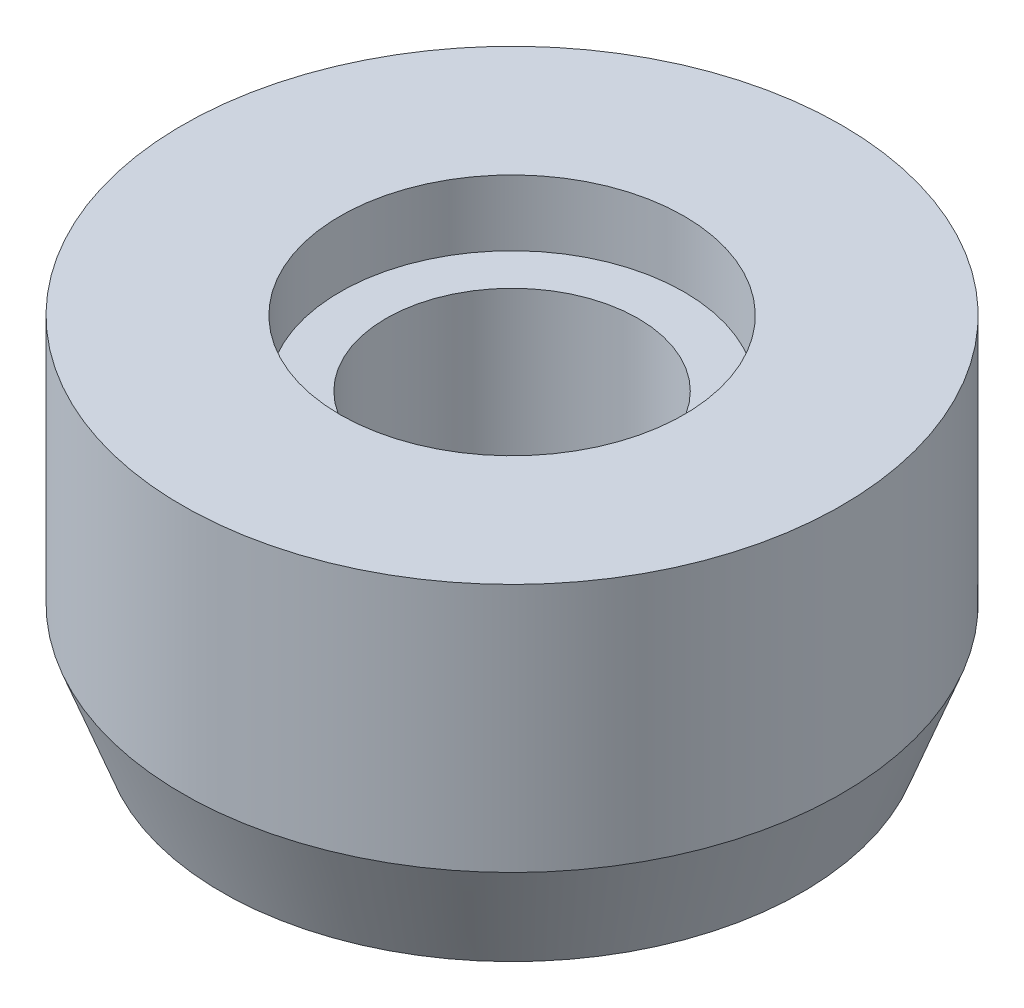
ISO-10303-21;
HEADER;
FILE_DESCRIPTION(('STEP AP214'),'2;1');
FILE_NAME('part.step','',(''),(''),'','','');
FILE_SCHEMA(('AUTOMOTIVE_DESIGN { 1 0 10303 214 1 1 1 1 }'));
ENDSEC;
DATA;
#1=APPLICATION_CONTEXT('core data for automotive mechanical design processes');
#2=APPLICATION_PROTOCOL_DEFINITION('international standard','automotive_design',2000,#1);
#3=PRODUCT_CONTEXT('',#1,'mechanical');
#4=PRODUCT('Part','Part','',(#3));
#5=PRODUCT_RELATED_PRODUCT_CATEGORY('part','',(#4));
#6=PRODUCT_DEFINITION_FORMATION('','',#4);
#7=PRODUCT_DEFINITION_CONTEXT('part definition',#1,'design');
#8=PRODUCT_DEFINITION('design','',#6,#7);
#9=PRODUCT_DEFINITION_SHAPE('','',#8);
#10=(LENGTH_UNIT() NAMED_UNIT(*) SI_UNIT(.MILLI.,.METRE.));
#11=(NAMED_UNIT(*) PLANE_ANGLE_UNIT() SI_UNIT($,.RADIAN.));
#12=(NAMED_UNIT(*) SI_UNIT($,.STERADIAN.) SOLID_ANGLE_UNIT());
#13=UNCERTAINTY_MEASURE_WITH_UNIT(LENGTH_MEASURE(1.E-05),#10,'distance_accuracy_value','');
#14=(GEOMETRIC_REPRESENTATION_CONTEXT(3) GLOBAL_UNCERTAINTY_ASSIGNED_CONTEXT((#13)) GLOBAL_UNIT_ASSIGNED_CONTEXT((#10,
#11,#12)) REPRESENTATION_CONTEXT('',''));
#15=CARTESIAN_POINT('',(0.,0.,0.));
#16=DIRECTION('',(0.,0.,1.));
#17=DIRECTION('',(1.,0.,0.));
#18=AXIS2_PLACEMENT_3D('',#15,#16,#17);
#19=CARTESIAN_POINT('',(0.,0.,0.));
#20=DIRECTION('',(0.,-1.,0.));
#21=DIRECTION('',(0.,0.,-1.));
#22=AXIS2_PLACEMENT_3D('',#19,#20,#21);
#23=CYLINDRICAL_SURFACE('',#22,4.8);
#24=CARTESIAN_POINT('',(0.,0.,0.));
#25=DIRECTION('',(0.,-1.,0.));
#26=DIRECTION('',(0.,0.,-1.));
#27=AXIS2_PLACEMENT_3D('',#24,#25,#26);
#28=CIRCLE('',#27,4.8);
#29=CARTESIAN_POINT('',(0.,0.,-4.8));
#30=VERTEX_POINT('',#29);
#31=EDGE_CURVE('E10',#30,#30,#28,.T.);
#32=ORIENTED_EDGE('',*,*,#31,.T.);
#33=EDGE_LOOP('',(#32));
#34=FACE_BOUND('',#33,.T.);
#35=CARTESIAN_POINT('',(0.,11.,0.));
#36=DIRECTION('',(0.,-1.,0.));
#37=DIRECTION('',(0.,0.,-1.));
#38=AXIS2_PLACEMENT_3D('',#35,#36,#37);
#39=CIRCLE('',#38,4.8);
#40=CARTESIAN_POINT('',(0.,11.,-4.8));
#41=VERTEX_POINT('',#40);
#42=EDGE_CURVE('E57',#41,#41,#39,.T.);
#43=ORIENTED_EDGE('',*,*,#42,.F.);
#44=EDGE_LOOP('',(#43));
#45=FACE_BOUND('',#44,.T.);
#46=ADVANCED_FACE('F32',(#34,#45),#23,.F.);
#47=CARTESIAN_POINT('',(4.8,0.,0.));
#48=DIRECTION('',(0.,-1.,0.));
#49=DIRECTION('',(0.,0.,-1.));
#50=AXIS2_PLACEMENT_3D('',#47,#48,#49);
#51=PLANE('',#50);
#52=CARTESIAN_POINT('',(0.,0.,0.));
#53=DIRECTION('',(0.,-1.,0.));
#54=DIRECTION('',(0.,0.,-1.));
#55=AXIS2_PLACEMENT_3D('',#52,#53,#54);
#56=CIRCLE('',#55,11.05);
#57=CARTESIAN_POINT('',(0.,0.,-11.05));
#58=VERTEX_POINT('',#57);
#59=EDGE_CURVE('E38',#58,#58,#56,.T.);
#60=ORIENTED_EDGE('',*,*,#59,.T.);
#61=EDGE_LOOP('',(#60));
#62=FACE_BOUND('',#61,.T.);
#63=ORIENTED_EDGE('',*,*,#31,.F.);
#64=EDGE_LOOP('',(#63));
#65=FACE_BOUND('',#64,.T.);
#66=ADVANCED_FACE('F65',(#62,#65),#51,.T.);
#67=CARTESIAN_POINT('',(0.,0.,0.));
#68=DIRECTION('',(0.,1.,0.));
#69=DIRECTION('',(0.,0.,1.));
#70=AXIS2_PLACEMENT_3D('',#67,#68,#69);
#71=CONICAL_SURFACE('',#70,11.05,0.358770670270572);
#72=CARTESIAN_POINT('',(0.,4.,0.));
#73=DIRECTION('',(0.,-1.,0.));
#74=DIRECTION('',(0.,0.,-1.));
#75=AXIS2_PLACEMENT_3D('',#72,#73,#74);
#76=CIRCLE('',#75,12.55);
#77=CARTESIAN_POINT('',(0.,4.,-12.55));
#78=VERTEX_POINT('',#77);
#79=EDGE_CURVE('E42',#78,#78,#76,.T.);
#80=ORIENTED_EDGE('',*,*,#79,.T.);
#81=EDGE_LOOP('',(#80));
#82=FACE_BOUND('',#81,.T.);
#83=ORIENTED_EDGE('',*,*,#59,.F.);
#84=EDGE_LOOP('',(#83));
#85=FACE_BOUND('',#84,.T.);
#86=ADVANCED_FACE('F69',(#82,#85),#71,.T.);
#87=CARTESIAN_POINT('',(0.,0.,0.));
#88=DIRECTION('',(0.,-1.,0.));
#89=DIRECTION('',(0.,0.,-1.));
#90=AXIS2_PLACEMENT_3D('',#87,#88,#89);
#91=CYLINDRICAL_SURFACE('',#90,12.55);
#92=CARTESIAN_POINT('',(0.,13.5,0.));
#93=DIRECTION('',(0.,-1.,0.));
#94=DIRECTION('',(0.,0.,-1.));
#95=AXIS2_PLACEMENT_3D('',#92,#93,#94);
#96=CIRCLE('',#95,12.55);
#97=CARTESIAN_POINT('',(0.,13.5,-12.55));
#98=VERTEX_POINT('',#97);
#99=EDGE_CURVE('E46',#98,#98,#96,.T.);
#100=ORIENTED_EDGE('',*,*,#99,.T.);
#101=EDGE_LOOP('',(#100));
#102=FACE_BOUND('',#101,.T.);
#103=ORIENTED_EDGE('',*,*,#79,.F.);
#104=EDGE_LOOP('',(#103));
#105=FACE_BOUND('',#104,.T.);
#106=ADVANCED_FACE('F73',(#102,#105),#91,.T.);
#107=CARTESIAN_POINT('',(12.55,13.5,0.));
#108=DIRECTION('',(0.,1.,0.));
#109=DIRECTION('',(0.,0.,1.));
#110=AXIS2_PLACEMENT_3D('',#107,#108,#109);
#111=PLANE('',#110);
#112=CARTESIAN_POINT('',(0.,13.5,0.));
#113=DIRECTION('',(0.,-1.,0.));
#114=DIRECTION('',(0.,0.,-1.));
#115=AXIS2_PLACEMENT_3D('',#112,#113,#114);
#116=CIRCLE('',#115,6.55);
#117=CARTESIAN_POINT('',(0.,13.5,-6.55));
#118=VERTEX_POINT('',#117);
#119=EDGE_CURVE('E51',#118,#118,#116,.T.);
#120=ORIENTED_EDGE('',*,*,#119,.T.);
#121=EDGE_LOOP('',(#120));
#122=FACE_BOUND('',#121,.T.);
#123=ORIENTED_EDGE('',*,*,#99,.F.);
#124=EDGE_LOOP('',(#123));
#125=FACE_BOUND('',#124,.T.);
#126=ADVANCED_FACE('F80',(#122,#125),#111,.T.);
#127=CARTESIAN_POINT('',(0.,0.,0.));
#128=DIRECTION('',(0.,-1.,0.));
#129=DIRECTION('',(0.,0.,-1.));
#130=AXIS2_PLACEMENT_3D('',#127,#128,#129);
#131=CYLINDRICAL_SURFACE('',#130,6.55);
#132=CARTESIAN_POINT('',(0.,11.,0.));
#133=DIRECTION('',(0.,-1.,0.));
#134=DIRECTION('',(0.,0.,-1.));
#135=AXIS2_PLACEMENT_3D('',#132,#133,#134);
#136=CIRCLE('',#135,6.55);
#137=CARTESIAN_POINT('',(0.,11.,-6.55));
#138=VERTEX_POINT('',#137);
#139=EDGE_CURVE('E54',#138,#138,#136,.T.);
#140=ORIENTED_EDGE('',*,*,#139,.T.);
#141=EDGE_LOOP('',(#140));
#142=FACE_BOUND('',#141,.T.);
#143=ORIENTED_EDGE('',*,*,#119,.F.);
#144=EDGE_LOOP('',(#143));
#145=FACE_BOUND('',#144,.T.);
#146=ADVANCED_FACE('F84',(#142,#145),#131,.F.);
#147=CARTESIAN_POINT('',(6.55,11.,0.));
#148=DIRECTION('',(0.,1.,0.));
#149=DIRECTION('',(0.,0.,1.));
#150=AXIS2_PLACEMENT_3D('',#147,#148,#149);
#151=PLANE('',#150);
#152=ORIENTED_EDGE('',*,*,#42,.T.);
#153=EDGE_LOOP('',(#152));
#154=FACE_BOUND('',#153,.T.);
#155=ORIENTED_EDGE('',*,*,#139,.F.);
#156=EDGE_LOOP('',(#155));
#157=FACE_BOUND('',#156,.T.);
#158=ADVANCED_FACE('F61',(#154,#157),#151,.T.);
#159=CLOSED_SHELL('',(#46,#66,#86,#106,#126,#146,#158));
#160=MANIFOLD_SOLID_BREP('B2',#159);
#161=ADVANCED_BREP_SHAPE_REPRESENTATION('',(#18,#160),#14);
#162=SHAPE_DEFINITION_REPRESENTATION(#9,#161);
ENDSEC;
END-ISO-10303-21;
